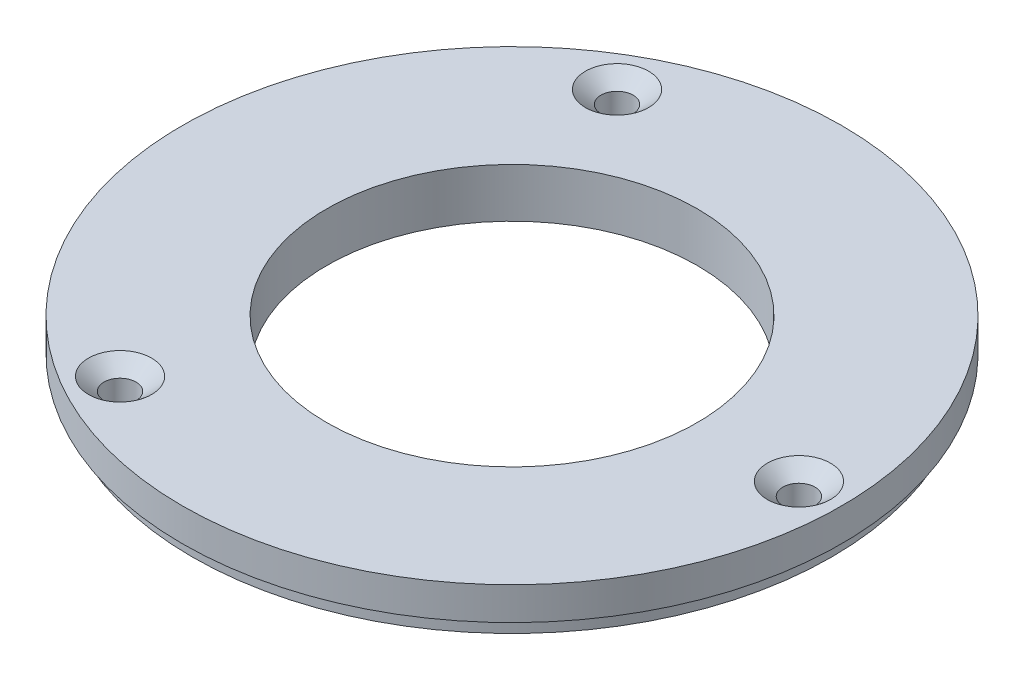
ISO-10303-21;
HEADER;
FILE_DESCRIPTION(('STEP AP214'),'2;1');
FILE_NAME('part.step','',(''),(''),'','','');
FILE_SCHEMA(('AUTOMOTIVE_DESIGN { 1 0 10303 214 1 1 1 1 }'));
ENDSEC;
DATA;
#1=APPLICATION_CONTEXT('core data for automotive mechanical design processes');
#2=APPLICATION_PROTOCOL_DEFINITION('international standard','automotive_design',2000,#1);
#3=PRODUCT_CONTEXT('',#1,'mechanical');
#4=PRODUCT('Part','Part','',(#3));
#5=PRODUCT_RELATED_PRODUCT_CATEGORY('part','',(#4));
#6=PRODUCT_DEFINITION_FORMATION('','',#4);
#7=PRODUCT_DEFINITION_CONTEXT('part definition',#1,'design');
#8=PRODUCT_DEFINITION('design','',#6,#7);
#9=PRODUCT_DEFINITION_SHAPE('','',#8);
#10=(LENGTH_UNIT() NAMED_UNIT(*) SI_UNIT(.MILLI.,.METRE.));
#11=(NAMED_UNIT(*) PLANE_ANGLE_UNIT() SI_UNIT($,.RADIAN.));
#12=(NAMED_UNIT(*) SI_UNIT($,.STERADIAN.) SOLID_ANGLE_UNIT());
#13=UNCERTAINTY_MEASURE_WITH_UNIT(LENGTH_MEASURE(1.E-05),#10,'distance_accuracy_value','');
#14=(GEOMETRIC_REPRESENTATION_CONTEXT(3) GLOBAL_UNCERTAINTY_ASSIGNED_CONTEXT((#13)) GLOBAL_UNIT_ASSIGNED_CONTEXT((#10,
#11,#12)) REPRESENTATION_CONTEXT('',''));
#15=CARTESIAN_POINT('',(0.,0.,0.));
#16=DIRECTION('',(0.,0.,1.));
#17=DIRECTION('',(1.,0.,0.));
#18=AXIS2_PLACEMENT_3D('',#15,#16,#17);
#19=CARTESIAN_POINT('',(0.,0.,0.));
#20=DIRECTION('',(0.,1.,0.));
#21=DIRECTION('',(0.,0.,1.));
#22=AXIS2_PLACEMENT_3D('',#19,#20,#21);
#23=PLANE('',#22);
#24=CARTESIAN_POINT('',(0.,0.,0.));
#25=DIRECTION('',(0.,1.,0.));
#26=DIRECTION('',(0.,0.,1.));
#27=AXIS2_PLACEMENT_3D('',#24,#25,#26);
#28=CIRCLE('',#27,28.702);
#29=CARTESIAN_POINT('',(0.,0.,-28.702));
#30=VERTEX_POINT('',#29);
#31=EDGE_CURVE('E45',#30,#30,#28,.T.);
#32=ORIENTED_EDGE('',*,*,#31,.T.);
#33=EDGE_LOOP('',(#32));
#34=FACE_BOUND('',#33,.T.);
#35=CARTESIAN_POINT('',(44.45,0.,0.));
#36=DIRECTION('',(0.,1.,0.));
#37=DIRECTION('',(0.,0.,1.));
#38=AXIS2_PLACEMENT_3D('',#35,#36,#37);
#39=CIRCLE('',#38,2.4892);
#40=CARTESIAN_POINT('',(44.45,0.,2.4892));
#41=VERTEX_POINT('',#40);
#42=EDGE_CURVE('E50',#41,#41,#39,.T.);
#43=ORIENTED_EDGE('',*,*,#42,.T.);
#44=EDGE_LOOP('',(#43));
#45=FACE_BOUND('',#44,.T.);
#46=CARTESIAN_POINT('',(-22.2250000000002,0.,-38.4948291982182));
#47=DIRECTION('',(0.,1.,0.));
#48=DIRECTION('',(0.,0.,1.));
#49=AXIS2_PLACEMENT_3D('',#46,#47,#48);
#50=CIRCLE('',#49,2.4892);
#51=CARTESIAN_POINT('',(-22.2250000000002,0.,-36.0056291982182));
#52=VERTEX_POINT('',#51);
#53=EDGE_CURVE('E60',#52,#52,#50,.T.);
#54=ORIENTED_EDGE('',*,*,#53,.T.);
#55=EDGE_LOOP('',(#54));
#56=FACE_BOUND('',#55,.T.);
#57=CARTESIAN_POINT('',(-22.2249999999996,0.,38.4948291982185));
#58=DIRECTION('',(0.,1.,0.));
#59=DIRECTION('',(0.,0.,1.));
#60=AXIS2_PLACEMENT_3D('',#57,#58,#59);
#61=CIRCLE('',#60,2.4892);
#62=CARTESIAN_POINT('',(-22.2249999999996,0.,40.9840291982185));
#63=VERTEX_POINT('',#62);
#64=EDGE_CURVE('E69',#63,#63,#61,.T.);
#65=ORIENTED_EDGE('',*,*,#64,.T.);
#66=EDGE_LOOP('',(#65));
#67=FACE_BOUND('',#66,.T.);
#68=CARTESIAN_POINT('',(0.,0.,0.));
#69=DIRECTION('',(0.,-1.,0.));
#70=DIRECTION('',(0.,0.,-1.));
#71=AXIS2_PLACEMENT_3D('',#68,#69,#70);
#72=CIRCLE('',#71,49.53);
#73=CARTESIAN_POINT('',(0.,0.,-49.53));
#74=VERTEX_POINT('',#73);
#75=EDGE_CURVE('E82',#74,#74,#72,.T.);
#76=ORIENTED_EDGE('',*,*,#75,.T.);
#77=EDGE_LOOP('',(#76));
#78=FACE_BOUND('',#77,.T.);
#79=ADVANCED_FACE('F34',(#34,#45,#56,#67,#78),#23,.F.);
#80=CARTESIAN_POINT('',(0.,7.62,0.));
#81=DIRECTION('',(0.,-1.,0.));
#82=DIRECTION('',(0.,0.,-1.));
#83=AXIS2_PLACEMENT_3D('',#80,#81,#82);
#84=CYLINDRICAL_SURFACE('',#83,51.054);
#85=CARTESIAN_POINT('',(0.,7.62,0.));
#86=DIRECTION('',(0.,1.,0.));
#87=DIRECTION('',(0.,0.,1.));
#88=AXIS2_PLACEMENT_3D('',#85,#86,#87);
#89=CIRCLE('',#88,51.054);
#90=CARTESIAN_POINT('',(0.,7.62,-51.054));
#91=VERTEX_POINT('',#90);
#92=EDGE_CURVE('E10',#91,#91,#89,.T.);
#93=CARTESIAN_POINT('',(0.,2.54,0.));
#94=DIRECTION('',(0.,-1.,0.));
#95=DIRECTION('',(0.,0.,-1.));
#96=AXIS2_PLACEMENT_3D('',#93,#94,#95);
#97=CIRCLE('',#96,51.054);
#98=CARTESIAN_POINT('',(0.,2.54,-51.054));
#99=VERTEX_POINT('',#98);
#100=EDGE_CURVE('E78',#99,#99,#97,.T.);
#101=CARTESIAN_POINT('',(0.,7.62,-51.054));
#102=CARTESIAN_POINT('',(0.,7.56708333333333,-51.054));
#103=CARTESIAN_POINT('',(0.,7.51416666666667,-51.054));
#104=CARTESIAN_POINT('',(0.,7.40833333333333,-51.054));
#105=CARTESIAN_POINT('',(0.,7.35541666666667,-51.054));
#106=CARTESIAN_POINT('',(0.,7.24958333333333,-51.054));
#107=CARTESIAN_POINT('',(0.,7.19666666666667,-51.054));
#108=CARTESIAN_POINT('',(0.,7.09083333333333,-51.054));
#109=CARTESIAN_POINT('',(0.,7.03791666666667,-51.054));
#110=CARTESIAN_POINT('',(0.,6.93208333333333,-51.054));
#111=CARTESIAN_POINT('',(0.,6.87916666666667,-51.054));
#112=CARTESIAN_POINT('',(0.,6.77333333333333,-51.054));
#113=CARTESIAN_POINT('',(0.,6.72041666666667,-51.054));
#114=CARTESIAN_POINT('',(0.,6.61458333333333,-51.054));
#115=CARTESIAN_POINT('',(0.,6.56166666666667,-51.054));
#116=CARTESIAN_POINT('',(0.,6.45583333333333,-51.054));
#117=CARTESIAN_POINT('',(0.,6.40291666666667,-51.054));
#118=CARTESIAN_POINT('',(0.,6.29708333333333,-51.054));
#119=CARTESIAN_POINT('',(0.,6.24416666666666,-51.054));
#120=CARTESIAN_POINT('',(0.,6.13833333333333,-51.054));
#121=CARTESIAN_POINT('',(0.,6.08541666666667,-51.054));
#122=CARTESIAN_POINT('',(0.,5.97958333333333,-51.054));
#123=CARTESIAN_POINT('',(0.,5.92666666666666,-51.054));
#124=CARTESIAN_POINT('',(0.,5.82083333333333,-51.054));
#125=CARTESIAN_POINT('',(0.,5.76791666666667,-51.054));
#126=CARTESIAN_POINT('',(0.,5.66208333333333,-51.054));
#127=CARTESIAN_POINT('',(0.,5.60916666666667,-51.054));
#128=CARTESIAN_POINT('',(0.,5.50333333333333,-51.054));
#129=CARTESIAN_POINT('',(0.,5.45041666666667,-51.054));
#130=CARTESIAN_POINT('',(0.,5.34458333333333,-51.054));
#131=CARTESIAN_POINT('',(0.,5.29166666666667,-51.054));
#132=CARTESIAN_POINT('',(0.,5.18583333333333,-51.054));
#133=CARTESIAN_POINT('',(0.,5.13291666666667,-51.054));
#134=CARTESIAN_POINT('',(0.,5.02708333333333,-51.054));
#135=CARTESIAN_POINT('',(0.,4.97416666666667,-51.054));
#136=CARTESIAN_POINT('',(0.,4.86833333333333,-51.054));
#137=CARTESIAN_POINT('',(0.,4.81541666666667,-51.054));
#138=CARTESIAN_POINT('',(0.,4.70958333333333,-51.054));
#139=CARTESIAN_POINT('',(0.,4.65666666666667,-51.054));
#140=CARTESIAN_POINT('',(0.,4.55083333333333,-51.054));
#141=CARTESIAN_POINT('',(0.,4.49791666666667,-51.054));
#142=CARTESIAN_POINT('',(0.,4.39208333333333,-51.054));
#143=CARTESIAN_POINT('',(0.,4.33916666666667,-51.054));
#144=CARTESIAN_POINT('',(0.,4.23333333333333,-51.054));
#145=CARTESIAN_POINT('',(0.,4.18041666666667,-51.054));
#146=CARTESIAN_POINT('',(0.,4.07458333333333,-51.054));
#147=CARTESIAN_POINT('',(0.,4.02166666666667,-51.054));
#148=CARTESIAN_POINT('',(0.,3.91583333333333,-51.054));
#149=CARTESIAN_POINT('',(0.,3.86291666666667,-51.054));
#150=CARTESIAN_POINT('',(0.,3.75708333333333,-51.054));
#151=CARTESIAN_POINT('',(0.,3.70416666666667,-51.054));
#152=CARTESIAN_POINT('',(0.,3.59833333333333,-51.054));
#153=CARTESIAN_POINT('',(0.,3.54541666666667,-51.054));
#154=CARTESIAN_POINT('',(0.,3.43958333333333,-51.054));
#155=CARTESIAN_POINT('',(0.,3.38666666666667,-51.054));
#156=CARTESIAN_POINT('',(0.,3.28083333333333,-51.054));
#157=CARTESIAN_POINT('',(0.,3.22791666666667,-51.054));
#158=CARTESIAN_POINT('',(0.,3.12208333333333,-51.054));
#159=CARTESIAN_POINT('',(0.,3.06916666666667,-51.054));
#160=CARTESIAN_POINT('',(0.,2.96333333333333,-51.054));
#161=CARTESIAN_POINT('',(0.,2.91041666666667,-51.054));
#162=CARTESIAN_POINT('',(0.,2.80458333333333,-51.054));
#163=CARTESIAN_POINT('',(0.,2.75166666666667,-51.054));
#164=CARTESIAN_POINT('',(0.,2.64583333333333,-51.054));
#165=CARTESIAN_POINT('',(0.,2.59291666666667,-51.054));
#166=CARTESIAN_POINT('',(0.,2.54,-51.054));
#167=B_SPLINE_CURVE_WITH_KNOTS('',3,(#101,#102,#103,#104,#105,#106,#107,#108,#109,#110,#111,
#112,#113,#114,#115,#116,#117,#118,#119,#120,#121,#122,#123,#124,#125,#126,#127,#128,#129,#130,
#131,#132,#133,#134,#135,#136,#137,#138,#139,#140,#141,#142,#143,#144,#145,#146,#147,#148,#149,
#150,#151,#152,#153,#154,#155,#156,#157,#158,#159,#160,#161,#162,#163,#164,#165,#166),
.UNSPECIFIED.,.F.,.F.,(4,2,2,2,2,2,2,2,2,2,2,2,2,2,2,2,2,2,2,2,2,2,2,2,2,2,2,2,2,2,2,2,4),(0.,
0.15875,0.3175,0.47625,0.635,0.79375,0.9525,1.11125,1.27,1.42875,1.5875,1.74625,1.905,2.06375,
2.2225,2.38125,2.54,2.69875,2.8575,3.01625,3.175,3.33375,3.4925,3.65125,3.81,3.96875,4.1275,
4.28625,4.445,4.60375,4.7625,4.92125,5.08),.UNSPECIFIED.);
#168=EDGE_CURVE('BSEAM36',#91,#99,#167,.T.);
#169=ORIENTED_EDGE('',*,*,#92,.F.);
#170=ORIENTED_EDGE('',*,*,#100,.F.);
#171=ORIENTED_EDGE('',*,*,#168,.T.);
#172=ORIENTED_EDGE('',*,*,#168,.F.);
#173=EDGE_LOOP('',(#169,#171,#170,#172));
#174=FACE_BOUND('',#173,.T.);
#175=ADVANCED_FACE('F36',(#174),#84,.T.);
#176=CARTESIAN_POINT('',(0.,7.62,0.));
#177=DIRECTION('',(0.,1.,0.));
#178=DIRECTION('',(0.,0.,1.));
#179=AXIS2_PLACEMENT_3D('',#176,#177,#178);
#180=PLANE('',#179);
#181=CARTESIAN_POINT('',(-22.2249999999996,7.62,38.4948291982185));
#182=DIRECTION('',(0.,1.,0.));
#183=DIRECTION('',(0.,0.,1.));
#184=AXIS2_PLACEMENT_3D('',#181,#182,#183);
#185=CIRCLE('',#184,4.8895);
#186=CARTESIAN_POINT('',(-22.2249999999996,7.62,43.3843291982185));
#187=VERTEX_POINT('',#186);
#188=EDGE_CURVE('E75',#187,#187,#185,.T.);
#189=ORIENTED_EDGE('',*,*,#188,.F.);
#190=EDGE_LOOP('',(#189));
#191=FACE_BOUND('',#190,.T.);
#192=CARTESIAN_POINT('',(-22.2250000000002,7.62,-38.4948291982182));
#193=DIRECTION('',(0.,1.,0.));
#194=DIRECTION('',(0.,0.,1.));
#195=AXIS2_PLACEMENT_3D('',#192,#193,#194);
#196=CIRCLE('',#195,4.8895);
#197=CARTESIAN_POINT('',(-22.2250000000002,7.62,-33.6053291982182));
#198=VERTEX_POINT('',#197);
#199=EDGE_CURVE('E66',#198,#198,#196,.T.);
#200=ORIENTED_EDGE('',*,*,#199,.F.);
#201=EDGE_LOOP('',(#200));
#202=FACE_BOUND('',#201,.T.);
#203=CARTESIAN_POINT('',(44.45,7.62,0.));
#204=DIRECTION('',(0.,1.,0.));
#205=DIRECTION('',(0.,0.,1.));
#206=AXIS2_PLACEMENT_3D('',#203,#204,#205);
#207=CIRCLE('',#206,4.8895);
#208=CARTESIAN_POINT('',(44.45,7.62,4.8895));
#209=VERTEX_POINT('',#208);
#210=EDGE_CURVE('E57',#209,#209,#207,.T.);
#211=ORIENTED_EDGE('',*,*,#210,.F.);
#212=EDGE_LOOP('',(#211));
#213=FACE_BOUND('',#212,.T.);
#214=ORIENTED_EDGE('',*,*,#92,.T.);
#215=EDGE_LOOP('',(#214));
#216=FACE_BOUND('',#215,.T.);
#217=CARTESIAN_POINT('',(0.,7.62,0.));
#218=DIRECTION('',(0.,1.,0.));
#219=DIRECTION('',(0.,0.,1.));
#220=AXIS2_PLACEMENT_3D('',#217,#218,#219);
#221=CIRCLE('',#220,28.702);
#222=CARTESIAN_POINT('',(0.,7.62,-28.702));
#223=VERTEX_POINT('',#222);
#224=EDGE_CURVE('E41',#223,#223,#221,.T.);
#225=ORIENTED_EDGE('',*,*,#224,.F.);
#226=EDGE_LOOP('',(#225));
#227=FACE_BOUND('',#226,.T.);
#228=ADVANCED_FACE('F99',(#191,#202,#213,#216,#227),#180,.T.);
#229=CARTESIAN_POINT('',(0.,7.62,0.));
#230=DIRECTION('',(0.,-1.,0.));
#231=DIRECTION('',(0.,0.,-1.));
#232=AXIS2_PLACEMENT_3D('',#229,#230,#231);
#233=CYLINDRICAL_SURFACE('',#232,28.702);
#234=CARTESIAN_POINT('',(0.,7.62,-28.702));
#235=CARTESIAN_POINT('',(0.,7.540625,-28.702));
#236=CARTESIAN_POINT('',(0.,7.46125,-28.702));
#237=CARTESIAN_POINT('',(0.,7.3025,-28.702));
#238=CARTESIAN_POINT('',(0.,7.223125,-28.702));
#239=CARTESIAN_POINT('',(0.,7.064375,-28.702));
#240=CARTESIAN_POINT('',(0.,6.985,-28.702));
#241=CARTESIAN_POINT('',(0.,6.82625,-28.702));
#242=CARTESIAN_POINT('',(0.,6.746875,-28.702));
#243=CARTESIAN_POINT('',(0.,6.588125,-28.702));
#244=CARTESIAN_POINT('',(0.,6.50875,-28.702));
#245=CARTESIAN_POINT('',(0.,6.35,-28.702));
#246=CARTESIAN_POINT('',(0.,6.270625,-28.702));
#247=CARTESIAN_POINT('',(0.,6.111875,-28.702));
#248=CARTESIAN_POINT('',(0.,6.0325,-28.702));
#249=CARTESIAN_POINT('',(0.,5.87375,-28.702));
#250=CARTESIAN_POINT('',(0.,5.794375,-28.702));
#251=CARTESIAN_POINT('',(0.,5.635625,-28.702));
#252=CARTESIAN_POINT('',(0.,5.55625,-28.702));
#253=CARTESIAN_POINT('',(0.,5.3975,-28.702));
#254=CARTESIAN_POINT('',(0.,5.318125,-28.702));
#255=CARTESIAN_POINT('',(0.,5.159375,-28.702));
#256=CARTESIAN_POINT('',(0.,5.08,-28.702));
#257=CARTESIAN_POINT('',(0.,4.92125,-28.702));
#258=CARTESIAN_POINT('',(0.,4.841875,-28.702));
#259=CARTESIAN_POINT('',(0.,4.683125,-28.702));
#260=CARTESIAN_POINT('',(0.,4.60375,-28.702));
#261=CARTESIAN_POINT('',(0.,4.445,-28.702));
#262=CARTESIAN_POINT('',(0.,4.365625,-28.702));
#263=CARTESIAN_POINT('',(0.,4.206875,-28.702));
#264=CARTESIAN_POINT('',(0.,4.1275,-28.702));
#265=CARTESIAN_POINT('',(0.,3.96875,-28.702));
#266=CARTESIAN_POINT('',(0.,3.889375,-28.702));
#267=CARTESIAN_POINT('',(0.,3.730625,-28.702));
#268=CARTESIAN_POINT('',(0.,3.65125,-28.702));
#269=CARTESIAN_POINT('',(0.,3.4925,-28.702));
#270=CARTESIAN_POINT('',(0.,3.413125,-28.702));
#271=CARTESIAN_POINT('',(0.,3.254375,-28.702));
#272=CARTESIAN_POINT('',(0.,3.175,-28.702));
#273=CARTESIAN_POINT('',(0.,3.01625,-28.702));
#274=CARTESIAN_POINT('',(0.,2.936875,-28.702));
#275=CARTESIAN_POINT('',(0.,2.778125,-28.702));
#276=CARTESIAN_POINT('',(0.,2.69875,-28.702));
#277=CARTESIAN_POINT('',(0.,2.54,-28.702));
#278=CARTESIAN_POINT('',(0.,2.460625,-28.702));
#279=CARTESIAN_POINT('',(0.,2.301875,-28.702));
#280=CARTESIAN_POINT('',(0.,2.2225,-28.702));
#281=CARTESIAN_POINT('',(0.,2.06375,-28.702));
#282=CARTESIAN_POINT('',(0.,1.984375,-28.702));
#283=CARTESIAN_POINT('',(0.,1.825625,-28.702));
#284=CARTESIAN_POINT('',(0.,1.74625,-28.702));
#285=CARTESIAN_POINT('',(0.,1.5875,-28.702));
#286=CARTESIAN_POINT('',(0.,1.508125,-28.702));
#287=CARTESIAN_POINT('',(0.,1.349375,-28.702));
#288=CARTESIAN_POINT('',(0.,1.27,-28.702));
#289=CARTESIAN_POINT('',(0.,1.11125,-28.702));
#290=CARTESIAN_POINT('',(0.,1.031875,-28.702));
#291=CARTESIAN_POINT('',(0.,0.873125,-28.702));
#292=CARTESIAN_POINT('',(0.,0.79375,-28.702));
#293=CARTESIAN_POINT('',(0.,0.635,-28.702));
#294=CARTESIAN_POINT('',(0.,0.555625,-28.702));
#295=CARTESIAN_POINT('',(0.,0.396875,-28.702));
#296=CARTESIAN_POINT('',(0.,0.3175,-28.702));
#297=CARTESIAN_POINT('',(0.,0.15875,-28.702));
#298=CARTESIAN_POINT('',(0.,0.0793749999999999,-28.702));
#299=CARTESIAN_POINT('',(0.,0.,-28.702));
#300=B_SPLINE_CURVE_WITH_KNOTS('',3,(#234,#235,#236,#237,#238,#239,#240,#241,#242,#243,#244,
#245,#246,#247,#248,#249,#250,#251,#252,#253,#254,#255,#256,#257,#258,#259,#260,#261,#262,#263,
#264,#265,#266,#267,#268,#269,#270,#271,#272,#273,#274,#275,#276,#277,#278,#279,#280,#281,#282,
#283,#284,#285,#286,#287,#288,#289,#290,#291,#292,#293,#294,#295,#296,#297,#298,#299),
.UNSPECIFIED.,.F.,.F.,(4,2,2,2,2,2,2,2,2,2,2,2,2,2,2,2,2,2,2,2,2,2,2,2,2,2,2,2,2,2,2,2,4),(0.,
0.238125,0.47625,0.714375000000001,0.9525,1.190625,1.42875,1.666875,1.905,2.143125,2.38125,
2.619375,2.8575,3.095625,3.33375,3.571875,3.81,4.048125,4.28625,4.524375,4.7625,5.000625,
5.23875,5.476875,5.715,5.953125,6.19125,6.429375,6.6675,6.905625,7.14375,7.381875,7.62),.UNSPECIFIED.);
#301=EDGE_CURVE('BSEAM105',#223,#30,#300,.T.);
#302=ORIENTED_EDGE('',*,*,#224,.T.);
#303=ORIENTED_EDGE('',*,*,#31,.F.);
#304=ORIENTED_EDGE('',*,*,#301,.T.);
#305=ORIENTED_EDGE('',*,*,#301,.F.);
#306=EDGE_LOOP('',(#302,#304,#303,#305));
#307=FACE_BOUND('',#306,.T.);
#308=ADVANCED_FACE('F105',(#307),#233,.F.);
#309=CARTESIAN_POINT('',(44.45,7.62,0.));
#310=DIRECTION('',(0.,1.,0.));
#311=DIRECTION('',(0.,0.,1.));
#312=AXIS2_PLACEMENT_3D('',#309,#310,#311);
#313=CYLINDRICAL_SURFACE('',#312,2.4892);
#314=ORIENTED_EDGE('',*,*,#42,.F.);
#315=EDGE_LOOP('',(#314));
#316=FACE_BOUND('',#315,.T.);
#317=CARTESIAN_POINT('',(44.45,5.60590915528517,0.));
#318=DIRECTION('',(0.,1.,0.));
#319=DIRECTION('',(0.,0.,1.));
#320=AXIS2_PLACEMENT_3D('',#317,#318,#319);
#321=CIRCLE('',#320,2.4892);
#322=CARTESIAN_POINT('',(44.45,5.60590915528517,2.4892));
#323=VERTEX_POINT('',#322);
#324=EDGE_CURVE('E54',#323,#323,#321,.T.);
#325=ORIENTED_EDGE('',*,*,#324,.T.);
#326=EDGE_LOOP('',(#325));
#327=FACE_BOUND('',#326,.T.);
#328=ADVANCED_FACE('F115',(#316,#327),#313,.F.);
#329=CARTESIAN_POINT('',(44.45,7.62,0.));
#330=DIRECTION('',(0.,1.,0.));
#331=DIRECTION('',(0.,0.,1.));
#332=AXIS2_PLACEMENT_3D('',#329,#330,#331);
#333=CONICAL_SURFACE('',#332,4.8895,0.872664625997164);
#334=ORIENTED_EDGE('',*,*,#324,.F.);
#335=EDGE_LOOP('',(#334));
#336=FACE_BOUND('',#335,.T.);
#337=ORIENTED_EDGE('',*,*,#210,.T.);
#338=EDGE_LOOP('',(#337));
#339=FACE_BOUND('',#338,.T.);
#340=ADVANCED_FACE('F118',(#336,#339),#333,.F.);
#341=CARTESIAN_POINT('',(-22.2250000000002,7.62,-38.4948291982182));
#342=DIRECTION('',(0.,1.,0.));
#343=DIRECTION('',(0.,0.,1.));
#344=AXIS2_PLACEMENT_3D('',#341,#342,#343);
#345=CYLINDRICAL_SURFACE('',#344,2.4892);
#346=ORIENTED_EDGE('',*,*,#53,.F.);
#347=EDGE_LOOP('',(#346));
#348=FACE_BOUND('',#347,.T.);
#349=CARTESIAN_POINT('',(-22.2250000000002,5.60590915528517,-38.4948291982182));
#350=DIRECTION('',(0.,1.,0.));
#351=DIRECTION('',(0.,0.,1.));
#352=AXIS2_PLACEMENT_3D('',#349,#350,#351);
#353=CIRCLE('',#352,2.4892);
#354=CARTESIAN_POINT('',(-22.2250000000002,5.60590915528517,-36.0056291982182));
#355=VERTEX_POINT('',#354);
#356=EDGE_CURVE('E63',#355,#355,#353,.T.);
#357=ORIENTED_EDGE('',*,*,#356,.T.);
#358=EDGE_LOOP('',(#357));
#359=FACE_BOUND('',#358,.T.);
#360=ADVANCED_FACE('F122',(#348,#359),#345,.F.);
#361=CARTESIAN_POINT('',(-22.2250000000002,7.62,-38.4948291982182));
#362=DIRECTION('',(0.,1.,0.));
#363=DIRECTION('',(0.,0.,1.));
#364=AXIS2_PLACEMENT_3D('',#361,#362,#363);
#365=CONICAL_SURFACE('',#364,4.8895,0.872664625997164);
#366=ORIENTED_EDGE('',*,*,#356,.F.);
#367=EDGE_LOOP('',(#366));
#368=FACE_BOUND('',#367,.T.);
#369=ORIENTED_EDGE('',*,*,#199,.T.);
#370=EDGE_LOOP('',(#369));
#371=FACE_BOUND('',#370,.T.);
#372=ADVANCED_FACE('F126',(#368,#371),#365,.F.);
#373=CARTESIAN_POINT('',(-22.2249999999996,7.62,38.4948291982185));
#374=DIRECTION('',(0.,1.,0.));
#375=DIRECTION('',(0.,0.,1.));
#376=AXIS2_PLACEMENT_3D('',#373,#374,#375);
#377=CYLINDRICAL_SURFACE('',#376,2.4892);
#378=ORIENTED_EDGE('',*,*,#64,.F.);
#379=EDGE_LOOP('',(#378));
#380=FACE_BOUND('',#379,.T.);
#381=CARTESIAN_POINT('',(-22.2249999999996,5.60590915528517,38.4948291982185));
#382=DIRECTION('',(0.,1.,0.));
#383=DIRECTION('',(0.,0.,1.));
#384=AXIS2_PLACEMENT_3D('',#381,#382,#383);
#385=CIRCLE('',#384,2.4892);
#386=CARTESIAN_POINT('',(-22.2249999999996,5.60590915528517,40.9840291982185));
#387=VERTEX_POINT('',#386);
#388=EDGE_CURVE('E72',#387,#387,#385,.T.);
#389=ORIENTED_EDGE('',*,*,#388,.T.);
#390=EDGE_LOOP('',(#389));
#391=FACE_BOUND('',#390,.T.);
#392=ADVANCED_FACE('F130',(#380,#391),#377,.F.);
#393=CARTESIAN_POINT('',(-22.2249999999996,7.62,38.4948291982185));
#394=DIRECTION('',(0.,1.,0.));
#395=DIRECTION('',(0.,0.,1.));
#396=AXIS2_PLACEMENT_3D('',#393,#394,#395);
#397=CONICAL_SURFACE('',#396,4.8895,0.872664625997164);
#398=ORIENTED_EDGE('',*,*,#388,.F.);
#399=EDGE_LOOP('',(#398));
#400=FACE_BOUND('',#399,.T.);
#401=ORIENTED_EDGE('',*,*,#188,.T.);
#402=EDGE_LOOP('',(#401));
#403=FACE_BOUND('',#402,.T.);
#404=ADVANCED_FACE('F94',(#400,#403),#397,.F.);
#405=CARTESIAN_POINT('',(0.,2.54,0.));
#406=DIRECTION('',(0.,-1.,0.));
#407=DIRECTION('',(0.,0.,-1.));
#408=AXIS2_PLACEMENT_3D('',#405,#406,#407);
#409=PLANE('',#408);
#410=CARTESIAN_POINT('',(0.,2.54,0.));
#411=DIRECTION('',(0.,-1.,0.));
#412=DIRECTION('',(0.,0.,-1.));
#413=AXIS2_PLACEMENT_3D('',#410,#411,#412);
#414=CIRCLE('',#413,49.53);
#415=CARTESIAN_POINT('',(0.,2.54,-49.53));
#416=VERTEX_POINT('',#415);
#417=EDGE_CURVE('E81',#416,#416,#414,.T.);
#418=ORIENTED_EDGE('',*,*,#417,.F.);
#419=EDGE_LOOP('',(#418));
#420=FACE_BOUND('',#419,.T.);
#421=ORIENTED_EDGE('',*,*,#100,.T.);
#422=EDGE_LOOP('',(#421));
#423=FACE_BOUND('',#422,.T.);
#424=ADVANCED_FACE('F91',(#420,#423),#409,.T.);
#425=CARTESIAN_POINT('',(0.,2.54,0.));
#426=DIRECTION('',(0.,-1.,0.));
#427=DIRECTION('',(0.,0.,-1.));
#428=AXIS2_PLACEMENT_3D('',#425,#426,#427);
#429=CYLINDRICAL_SURFACE('',#428,49.53);
#430=ORIENTED_EDGE('',*,*,#417,.T.);
#431=EDGE_LOOP('',(#430));
#432=FACE_BOUND('',#431,.T.);
#433=ORIENTED_EDGE('',*,*,#75,.F.);
#434=EDGE_LOOP('',(#433));
#435=FACE_BOUND('',#434,.T.);
#436=ADVANCED_FACE('F88',(#432,#435),#429,.T.);
#437=CLOSED_SHELL('',(#79,#175,#228,#308,#328,#340,#360,#372,#392,#404,#424,#436));
#438=MANIFOLD_SOLID_BREP('B2',#437);
#439=ADVANCED_BREP_SHAPE_REPRESENTATION('',(#18,#438),#14);
#440=SHAPE_DEFINITION_REPRESENTATION(#9,#439);
ENDSEC;
END-ISO-10303-21;
